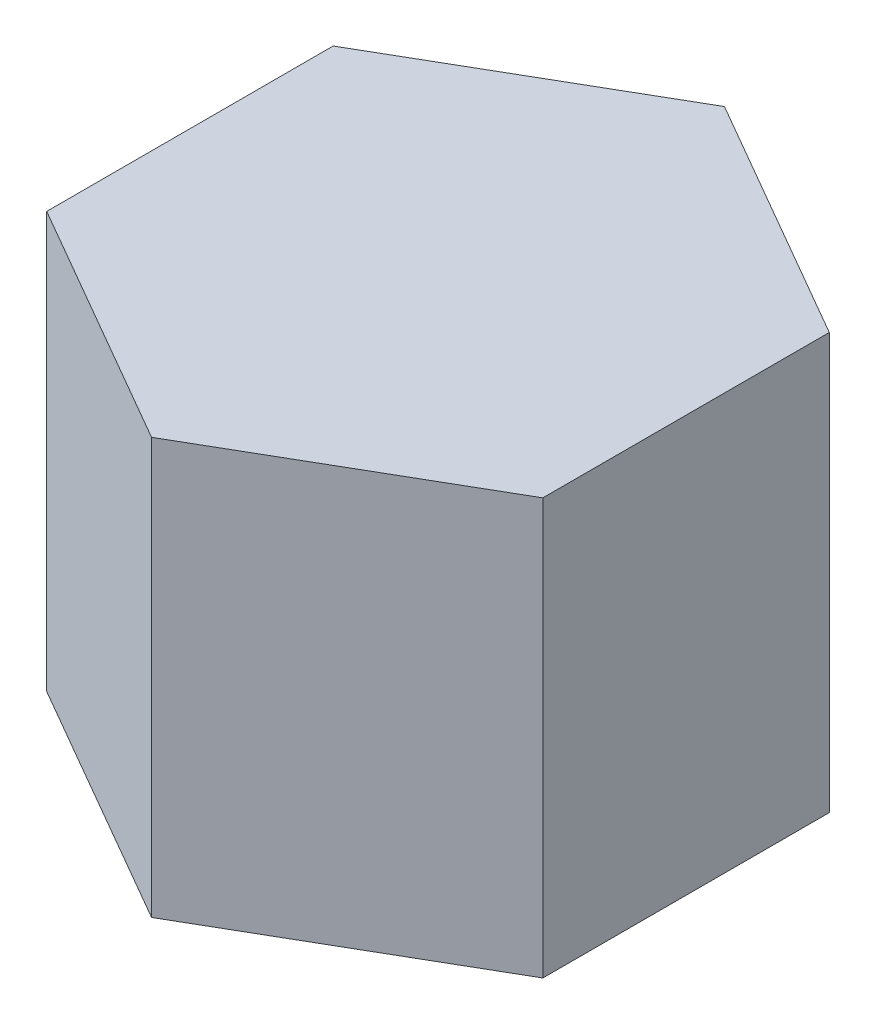
ISO-10303-21;
HEADER;
FILE_DESCRIPTION(('STEP AP214'),'2;1');
FILE_NAME('part.step','',(''),(''),'','','');
FILE_SCHEMA(('AUTOMOTIVE_DESIGN { 1 0 10303 214 1 1 1 1 }'));
ENDSEC;
DATA;
#1=APPLICATION_CONTEXT('core data for automotive mechanical design processes');
#2=APPLICATION_PROTOCOL_DEFINITION('international standard','automotive_design',2000,#1);
#3=PRODUCT_CONTEXT('',#1,'mechanical');
#4=PRODUCT('Part','Part','',(#3));
#5=PRODUCT_RELATED_PRODUCT_CATEGORY('part','',(#4));
#6=PRODUCT_DEFINITION_FORMATION('','',#4);
#7=PRODUCT_DEFINITION_CONTEXT('part definition',#1,'design');
#8=PRODUCT_DEFINITION('design','',#6,#7);
#9=PRODUCT_DEFINITION_SHAPE('','',#8);
#10=(LENGTH_UNIT() NAMED_UNIT(*) SI_UNIT(.MILLI.,.METRE.));
#11=(NAMED_UNIT(*) PLANE_ANGLE_UNIT() SI_UNIT($,.RADIAN.));
#12=(NAMED_UNIT(*) SI_UNIT($,.STERADIAN.) SOLID_ANGLE_UNIT());
#13=UNCERTAINTY_MEASURE_WITH_UNIT(LENGTH_MEASURE(1.E-05),#10,'distance_accuracy_value','');
#14=(GEOMETRIC_REPRESENTATION_CONTEXT(3) GLOBAL_UNCERTAINTY_ASSIGNED_CONTEXT((#13)) GLOBAL_UNIT_ASSIGNED_CONTEXT((#10,
#11,#12)) REPRESENTATION_CONTEXT('',''));
#15=CARTESIAN_POINT('',(0.,0.,0.));
#16=DIRECTION('',(0.,0.,1.));
#17=DIRECTION('',(1.,0.,0.));
#18=AXIS2_PLACEMENT_3D('',#15,#16,#17);
#19=CARTESIAN_POINT('',(208.142660308706,-148.537700895744,295.837098239417));
#20=DIRECTION('',(-0.499999999999909,0.,-0.866025403784491));
#21=DIRECTION('',(-0.866025403784491,0.,0.499999999999909));
#22=AXIS2_PLACEMENT_3D('',#19,#20,#21);
#23=PLANE('',#22);
#24=CARTESIAN_POINT('',(207.839551417381,-149.045793579175,296.012098239417));
#25=DIRECTION('',(0.866025403784491,0.,-0.499999999999909));
#26=VECTOR('',#25,1.);
#27=LINE('',#24,#26);
#28=CARTESIAN_POINT('',(207.839551417382,-149.045793579175,296.012098239417));
#29=VERTEX_POINT('',#28);
#30=CARTESIAN_POINT('',(208.142660308706,-149.045793579175,295.837098239417));
#31=VERTEX_POINT('',#30);
#32=EDGE_CURVE('E170',#29,#31,#27,.T.);
#33=ORIENTED_EDGE('',*,*,#32,.T.);
#34=CARTESIAN_POINT('',(208.142660308706,-148.537700895744,295.837098239417));
#35=DIRECTION('',(0.,-1.,0.));
#36=VECTOR('',#35,1.);
#37=LINE('',#34,#36);
#38=CARTESIAN_POINT('',(208.142660308706,-148.537700895744,295.837098239417));
#39=VERTEX_POINT('',#38);
#40=EDGE_CURVE('E35',#39,#31,#37,.T.);
#41=ORIENTED_EDGE('',*,*,#40,.F.);
#42=CARTESIAN_POINT('',(207.839551417381,-148.537700895744,296.012098239417));
#43=DIRECTION('',(0.866025403784491,0.,-0.499999999999909));
#44=VECTOR('',#43,1.);
#45=LINE('',#42,#44);
#46=CARTESIAN_POINT('',(207.839551417382,-148.537700895744,296.012098239417));
#47=VERTEX_POINT('',#46);
#48=EDGE_CURVE('E159',#47,#39,#45,.T.);
#49=ORIENTED_EDGE('',*,*,#48,.F.);
#50=CARTESIAN_POINT('',(207.839551417381,-148.537700895744,296.012098239417));
#51=DIRECTION('',(0.,-1.,0.));
#52=VECTOR('',#51,1.);
#53=LINE('',#50,#52);
#54=EDGE_CURVE('E10',#47,#29,#53,.T.);
#55=ORIENTED_EDGE('',*,*,#54,.T.);
#56=EDGE_LOOP('',(#33,#41,#49,#55));
#57=FACE_BOUND('',#56,.T.);
#58=ADVANCED_FACE('F16',(#57),#23,.F.);
#59=CARTESIAN_POINT('',(207.839551417382,-148.537700895744,296.012098239417));
#60=DIRECTION('',(0.500000000000062,0.,-0.866025403784403));
#61=DIRECTION('',(-0.866025403784403,0.,-0.500000000000062));
#62=AXIS2_PLACEMENT_3D('',#59,#60,#61);
#63=PLANE('',#62);
#64=CARTESIAN_POINT('',(207.536442526057,-149.045793579175,295.837098239417));
#65=DIRECTION('',(0.866025403784403,0.,0.500000000000062));
#66=VECTOR('',#65,1.);
#67=LINE('',#64,#66);
#68=CARTESIAN_POINT('',(207.536442526057,-149.045793579175,295.837098239417));
#69=VERTEX_POINT('',#68);
#70=EDGE_CURVE('E167',#69,#29,#67,.T.);
#71=ORIENTED_EDGE('',*,*,#70,.T.);
#72=ORIENTED_EDGE('',*,*,#54,.F.);
#73=CARTESIAN_POINT('',(207.536442526057,-148.537700895744,295.837098239417));
#74=DIRECTION('',(0.866025403784403,0.,0.500000000000062));
#75=VECTOR('',#74,1.);
#76=LINE('',#73,#75);
#77=CARTESIAN_POINT('',(207.536442526057,-148.537700895744,295.837098239417));
#78=VERTEX_POINT('',#77);
#79=EDGE_CURVE('E156',#78,#47,#76,.T.);
#80=ORIENTED_EDGE('',*,*,#79,.F.);
#81=CARTESIAN_POINT('',(207.536442526057,-148.537700895744,295.837098239417));
#82=DIRECTION('',(0.,-1.,0.));
#83=VECTOR('',#82,1.);
#84=LINE('',#81,#83);
#85=EDGE_CURVE('E27',#78,#69,#84,.T.);
#86=ORIENTED_EDGE('',*,*,#85,.T.);
#87=EDGE_LOOP('',(#71,#72,#80,#86));
#88=FACE_BOUND('',#87,.T.);
#89=ADVANCED_FACE('F189',(#88),#63,.F.);
#90=CARTESIAN_POINT('',(207.536442526057,-148.537700895744,290.831971220494));
#91=DIRECTION('',(1.,0.,0.));
#92=DIRECTION('',(0.,1.,0.));
#93=AXIS2_PLACEMENT_3D('',#90,#91,#92);
#94=PLANE('',#93);
#95=CARTESIAN_POINT('',(207.536442526057,-149.045793579175,295.487098239417));
#96=DIRECTION('',(0.,0.,1.));
#97=VECTOR('',#96,1.);
#98=LINE('',#95,#97);
#99=CARTESIAN_POINT('',(207.536442526057,-149.045793579175,295.487098239417));
#100=VERTEX_POINT('',#99);
#101=EDGE_CURVE('E163',#100,#69,#98,.T.);
#102=ORIENTED_EDGE('',*,*,#101,.T.);
#103=ORIENTED_EDGE('',*,*,#85,.F.);
#104=CARTESIAN_POINT('',(207.536442526057,-148.537700895744,295.487098239417));
#105=DIRECTION('',(0.,0.,1.));
#106=VECTOR('',#105,1.);
#107=LINE('',#104,#106);
#108=CARTESIAN_POINT('',(207.536442526057,-148.537700895744,295.487098239417));
#109=VERTEX_POINT('',#108);
#110=EDGE_CURVE('E106',#109,#78,#107,.T.);
#111=ORIENTED_EDGE('',*,*,#110,.F.);
#112=CARTESIAN_POINT('',(207.536442526057,-148.537700895744,295.487098239417));
#113=DIRECTION('',(0.,-1.,0.));
#114=VECTOR('',#113,1.);
#115=LINE('',#112,#114);
#116=EDGE_CURVE('E94',#109,#100,#115,.T.);
#117=ORIENTED_EDGE('',*,*,#116,.T.);
#118=EDGE_LOOP('',(#102,#103,#111,#117));
#119=FACE_BOUND('',#118,.T.);
#120=ADVANCED_FACE('F198',(#119),#94,.F.);
#121=CARTESIAN_POINT('',(207.536442526057,-148.537700895744,295.487098239417));
#122=DIRECTION('',(0.499999999999978,0.,0.866025403784452));
#123=DIRECTION('',(0.866025403784452,0.,-0.499999999999978));
#124=AXIS2_PLACEMENT_3D('',#121,#122,#123);
#125=PLANE('',#124);
#126=CARTESIAN_POINT('',(207.839551417382,-149.045793579175,295.312098239417));
#127=DIRECTION('',(-0.866025403784452,0.,0.499999999999978));
#128=VECTOR('',#127,1.);
#129=LINE('',#126,#128);
#130=CARTESIAN_POINT('',(207.839551417382,-149.045793579175,295.312098239417));
#131=VERTEX_POINT('',#130);
#132=EDGE_CURVE('E162',#131,#100,#129,.T.);
#133=ORIENTED_EDGE('',*,*,#132,.T.);
#134=ORIENTED_EDGE('',*,*,#116,.F.);
#135=CARTESIAN_POINT('',(207.839551417382,-148.537700895744,295.312098239417));
#136=DIRECTION('',(-0.866025403784452,0.,0.499999999999978));
#137=VECTOR('',#136,1.);
#138=LINE('',#135,#137);
#139=CARTESIAN_POINT('',(207.839551417382,-148.537700895744,295.312098239417));
#140=VERTEX_POINT('',#139);
#141=EDGE_CURVE('E98',#140,#109,#138,.T.);
#142=ORIENTED_EDGE('',*,*,#141,.F.);
#143=CARTESIAN_POINT('',(207.839551417382,-148.537700895744,295.312098239417));
#144=DIRECTION('',(0.,-1.,0.));
#145=VECTOR('',#144,1.);
#146=LINE('',#143,#145);
#147=EDGE_CURVE('E79',#140,#131,#146,.T.);
#148=ORIENTED_EDGE('',*,*,#147,.T.);
#149=EDGE_LOOP('',(#133,#134,#142,#148));
#150=FACE_BOUND('',#149,.T.);
#151=ADVANCED_FACE('F100',(#150),#125,.F.);
#152=CARTESIAN_POINT('',(207.839551417382,-148.537700895744,295.312098239417));
#153=DIRECTION('',(-0.500000000000012,0.,0.866025403784432));
#154=DIRECTION('',(0.866025403784432,0.,0.500000000000012));
#155=AXIS2_PLACEMENT_3D('',#152,#153,#154);
#156=PLANE('',#155);
#157=CARTESIAN_POINT('',(208.142660308706,-149.045793579175,295.487098239417));
#158=DIRECTION('',(-0.866025403784432,0.,-0.500000000000012));
#159=VECTOR('',#158,1.);
#160=LINE('',#157,#159);
#161=CARTESIAN_POINT('',(208.142660308706,-149.045793579175,295.487098239417));
#162=VERTEX_POINT('',#161);
#163=EDGE_CURVE('E88',#162,#131,#160,.T.);
#164=ORIENTED_EDGE('',*,*,#163,.T.);
#165=ORIENTED_EDGE('',*,*,#147,.F.);
#166=CARTESIAN_POINT('',(208.142660308706,-148.537700895744,295.487098239417));
#167=DIRECTION('',(-0.866025403784432,0.,-0.500000000000012));
#168=VECTOR('',#167,1.);
#169=LINE('',#166,#168);
#170=CARTESIAN_POINT('',(208.142660308706,-148.537700895744,295.487098239417));
#171=VERTEX_POINT('',#170);
#172=EDGE_CURVE('E84',#171,#140,#169,.T.);
#173=ORIENTED_EDGE('',*,*,#172,.F.);
#174=CARTESIAN_POINT('',(208.142660308706,-148.537700895744,295.487098239417));
#175=DIRECTION('',(0.,-1.,0.));
#176=VECTOR('',#175,1.);
#177=LINE('',#174,#176);
#178=EDGE_CURVE('E58',#171,#162,#177,.T.);
#179=ORIENTED_EDGE('',*,*,#178,.T.);
#180=EDGE_LOOP('',(#164,#165,#173,#179));
#181=FACE_BOUND('',#180,.T.);
#182=ADVANCED_FACE('F82',(#181),#156,.F.);
#183=CARTESIAN_POINT('',(208.142660308706,-148.537700895744,290.831971220494));
#184=DIRECTION('',(-1.,0.,0.));
#185=DIRECTION('',(0.,-1.,0.));
#186=AXIS2_PLACEMENT_3D('',#183,#184,#185);
#187=PLANE('',#186);
#188=CARTESIAN_POINT('',(208.142660308706,-149.045793579175,295.837098239417));
#189=DIRECTION('',(0.,0.,-1.));
#190=VECTOR('',#189,1.);
#191=LINE('',#188,#190);
#192=EDGE_CURVE('E160',#31,#162,#191,.T.);
#193=ORIENTED_EDGE('',*,*,#192,.T.);
#194=ORIENTED_EDGE('',*,*,#178,.F.);
#195=CARTESIAN_POINT('',(208.142660308706,-148.537700895744,295.837098239417));
#196=DIRECTION('',(0.,0.,-1.));
#197=VECTOR('',#196,1.);
#198=LINE('',#195,#197);
#199=EDGE_CURVE('E112',#39,#171,#198,.T.);
#200=ORIENTED_EDGE('',*,*,#199,.F.);
#201=ORIENTED_EDGE('',*,*,#40,.T.);
#202=EDGE_LOOP('',(#193,#194,#200,#201));
#203=FACE_BOUND('',#202,.T.);
#204=ADVANCED_FACE('F131',(#203),#187,.F.);
#205=CARTESIAN_POINT('',(206.339551417382,-148.537700895744,290.831971220494));
#206=DIRECTION('',(0.,-1.,0.));
#207=DIRECTION('',(1.,0.,0.));
#208=AXIS2_PLACEMENT_3D('',#205,#206,#207);
#209=PLANE('',#208);
#210=ORIENTED_EDGE('',*,*,#48,.T.);
#211=ORIENTED_EDGE('',*,*,#199,.T.);
#212=ORIENTED_EDGE('',*,*,#172,.T.);
#213=ORIENTED_EDGE('',*,*,#141,.T.);
#214=ORIENTED_EDGE('',*,*,#110,.T.);
#215=ORIENTED_EDGE('',*,*,#79,.T.);
#216=EDGE_LOOP('',(#210,#211,#212,#213,#214,#215));
#217=FACE_BOUND('',#216,.T.);
#218=ADVANCED_FACE('F111',(#217),#209,.F.);
#219=CARTESIAN_POINT('',(206.339551417382,-149.045793579175,290.831971220494));
#220=DIRECTION('',(0.,-1.,0.));
#221=DIRECTION('',(1.,0.,0.));
#222=AXIS2_PLACEMENT_3D('',#219,#220,#221);
#223=PLANE('',#222);
#224=ORIENTED_EDGE('',*,*,#32,.F.);
#225=ORIENTED_EDGE('',*,*,#70,.F.);
#226=ORIENTED_EDGE('',*,*,#101,.F.);
#227=ORIENTED_EDGE('',*,*,#132,.F.);
#228=ORIENTED_EDGE('',*,*,#163,.F.);
#229=ORIENTED_EDGE('',*,*,#192,.F.);
#230=EDGE_LOOP('',(#224,#225,#226,#227,#228,#229));
#231=FACE_BOUND('',#230,.T.);
#232=ADVANCED_FACE('F130',(#231),#223,.T.);
#233=CLOSED_SHELL('',(#58,#89,#120,#151,#182,#204,#218,#232));
#234=MANIFOLD_SOLID_BREP('B1',#233);
#235=ADVANCED_BREP_SHAPE_REPRESENTATION('',(#18,#234),#14);
#236=SHAPE_DEFINITION_REPRESENTATION(#9,#235);
ENDSEC;
END-ISO-10303-21;
